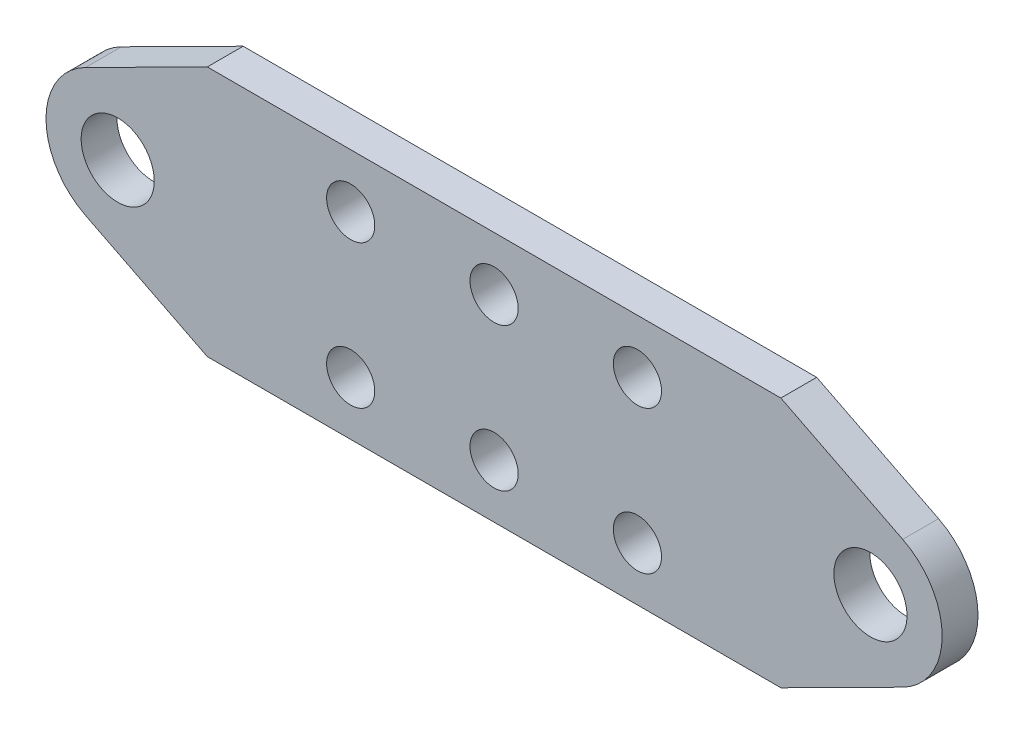
ISO-10303-21;
HEADER;
FILE_DESCRIPTION(('STEP AP214'),'2;1');
FILE_NAME('part.step','',(''),(''),'','','');
FILE_SCHEMA(('AUTOMOTIVE_DESIGN { 1 0 10303 214 1 1 1 1 }'));
ENDSEC;
DATA;
#1=APPLICATION_CONTEXT('core data for automotive mechanical design processes');
#2=APPLICATION_PROTOCOL_DEFINITION('international standard','automotive_design',2000,#1);
#3=PRODUCT_CONTEXT('',#1,'mechanical');
#4=PRODUCT('Part','Part','',(#3));
#5=PRODUCT_RELATED_PRODUCT_CATEGORY('part','',(#4));
#6=PRODUCT_DEFINITION_FORMATION('','',#4);
#7=PRODUCT_DEFINITION_CONTEXT('part definition',#1,'design');
#8=PRODUCT_DEFINITION('design','',#6,#7);
#9=PRODUCT_DEFINITION_SHAPE('','',#8);
#10=(LENGTH_UNIT() NAMED_UNIT(*) SI_UNIT(.MILLI.,.METRE.));
#11=(NAMED_UNIT(*) PLANE_ANGLE_UNIT() SI_UNIT($,.RADIAN.));
#12=(NAMED_UNIT(*) SI_UNIT($,.STERADIAN.) SOLID_ANGLE_UNIT());
#13=UNCERTAINTY_MEASURE_WITH_UNIT(LENGTH_MEASURE(1.E-05),#10,'distance_accuracy_value','');
#14=(GEOMETRIC_REPRESENTATION_CONTEXT(3) GLOBAL_UNCERTAINTY_ASSIGNED_CONTEXT((#13)) GLOBAL_UNIT_ASSIGNED_CONTEXT((#10,
#11,#12)) REPRESENTATION_CONTEXT('',''));
#15=CARTESIAN_POINT('',(0.,0.,0.));
#16=DIRECTION('',(0.,0.,1.));
#17=DIRECTION('',(1.,0.,0.));
#18=AXIS2_PLACEMENT_3D('',#15,#16,#17);
#19=CARTESIAN_POINT('',(0.,0.,0.));
#20=DIRECTION('',(0.,0.,1.));
#21=DIRECTION('',(1.,0.,0.));
#22=AXIS2_PLACEMENT_3D('',#19,#20,#21);
#23=PLANE('',#22);
#24=CARTESIAN_POINT('',(33.3375,0.,0.));
#25=DIRECTION('',(0.,0.,-1.));
#26=DIRECTION('',(-1.,0.,0.));
#27=AXIS2_PLACEMENT_3D('',#24,#25,#26);
#28=CIRCLE('',#27,3.2385);
#29=CARTESIAN_POINT('',(30.099,0.,0.));
#30=VERTEX_POINT('',#29);
#31=EDGE_CURVE('E165',#30,#30,#28,.F.);
#32=ORIENTED_EDGE('',*,*,#31,.T.);
#33=EDGE_LOOP('',(#32));
#34=FACE_BOUND('',#33,.T.);
#35=CARTESIAN_POINT('',(-33.3375,0.,0.));
#36=DIRECTION('',(0.,0.,-1.));
#37=DIRECTION('',(-1.,0.,0.));
#38=AXIS2_PLACEMENT_3D('',#35,#36,#37);
#39=CIRCLE('',#38,3.2385);
#40=CARTESIAN_POINT('',(-36.576,0.,0.));
#41=VERTEX_POINT('',#40);
#42=EDGE_CURVE('E168',#41,#41,#39,.F.);
#43=ORIENTED_EDGE('',*,*,#42,.T.);
#44=EDGE_LOOP('',(#43));
#45=FACE_BOUND('',#44,.T.);
#46=CARTESIAN_POINT('',(-12.7,-6.35,0.));
#47=DIRECTION('',(0.,0.,-1.));
#48=DIRECTION('',(-1.,0.,0.));
#49=AXIS2_PLACEMENT_3D('',#46,#47,#48);
#50=CIRCLE('',#49,2.1336);
#51=CARTESIAN_POINT('',(-14.8336,-6.35,0.));
#52=VERTEX_POINT('',#51);
#53=EDGE_CURVE('E171',#52,#52,#50,.F.);
#54=ORIENTED_EDGE('',*,*,#53,.T.);
#55=EDGE_LOOP('',(#54));
#56=FACE_BOUND('',#55,.T.);
#57=CARTESIAN_POINT('',(0.,-6.35,0.));
#58=DIRECTION('',(0.,0.,-1.));
#59=DIRECTION('',(-1.,0.,0.));
#60=AXIS2_PLACEMENT_3D('',#57,#58,#59);
#61=CIRCLE('',#60,2.1336);
#62=CARTESIAN_POINT('',(-2.13360000000001,-6.35,0.));
#63=VERTEX_POINT('',#62);
#64=EDGE_CURVE('E174',#63,#63,#61,.F.);
#65=ORIENTED_EDGE('',*,*,#64,.T.);
#66=EDGE_LOOP('',(#65));
#67=FACE_BOUND('',#66,.T.);
#68=CARTESIAN_POINT('',(12.7,-6.35,0.));
#69=DIRECTION('',(0.,0.,-1.));
#70=DIRECTION('',(-1.,0.,0.));
#71=AXIS2_PLACEMENT_3D('',#68,#69,#70);
#72=CIRCLE('',#71,2.1336);
#73=CARTESIAN_POINT('',(10.5664,-6.35,0.));
#74=VERTEX_POINT('',#73);
#75=EDGE_CURVE('E177',#74,#74,#72,.F.);
#76=ORIENTED_EDGE('',*,*,#75,.T.);
#77=EDGE_LOOP('',(#76));
#78=FACE_BOUND('',#77,.T.);
#79=CARTESIAN_POINT('',(12.7,6.35,0.));
#80=DIRECTION('',(0.,0.,-1.));
#81=DIRECTION('',(-1.,0.,0.));
#82=AXIS2_PLACEMENT_3D('',#79,#80,#81);
#83=CIRCLE('',#82,2.1336);
#84=CARTESIAN_POINT('',(10.5664,6.35,0.));
#85=VERTEX_POINT('',#84);
#86=EDGE_CURVE('E180',#85,#85,#83,.F.);
#87=ORIENTED_EDGE('',*,*,#86,.T.);
#88=EDGE_LOOP('',(#87));
#89=FACE_BOUND('',#88,.T.);
#90=CARTESIAN_POINT('',(0.,6.35,0.));
#91=DIRECTION('',(0.,0.,-1.));
#92=DIRECTION('',(-1.,0.,0.));
#93=AXIS2_PLACEMENT_3D('',#90,#91,#92);
#94=CIRCLE('',#93,2.1336);
#95=CARTESIAN_POINT('',(-2.13360000000001,6.35,0.));
#96=VERTEX_POINT('',#95);
#97=EDGE_CURVE('E183',#96,#96,#94,.F.);
#98=ORIENTED_EDGE('',*,*,#97,.T.);
#99=EDGE_LOOP('',(#98));
#100=FACE_BOUND('',#99,.T.);
#101=CARTESIAN_POINT('',(-12.7,6.35,0.));
#102=DIRECTION('',(0.,0.,-1.));
#103=DIRECTION('',(-1.,0.,0.));
#104=AXIS2_PLACEMENT_3D('',#101,#102,#103);
#105=CIRCLE('',#104,2.1336);
#106=CARTESIAN_POINT('',(-14.8336,6.35,0.));
#107=VERTEX_POINT('',#106);
#108=EDGE_CURVE('E118',#107,#107,#105,.F.);
#109=ORIENTED_EDGE('',*,*,#108,.T.);
#110=EDGE_LOOP('',(#109));
#111=FACE_BOUND('',#110,.T.);
#112=DIRECTION('',(1.,0.,0.));
#113=VECTOR('',#112,1.);
#114=CARTESIAN_POINT('',(0.,-11.1125,0.));
#115=LINE('',#114,#113);
#116=CARTESIAN_POINT('',(25.4,-11.1125,0.));
#117=VERTEX_POINT('',#116);
#118=CARTESIAN_POINT('',(-25.4,-11.1125,0.));
#119=VERTEX_POINT('',#118);
#120=EDGE_CURVE('E111',#117,#119,#115,.F.);
#121=ORIENTED_EDGE('',*,*,#120,.T.);
#122=DIRECTION('',(0.892957642288102,-0.450140699203343,0.));
#123=VECTOR('',#122,1.);
#124=CARTESIAN_POINT('',(-9.61345935362153,-19.0705084295533,0.));
#125=LINE('',#124,#123);
#126=CARTESIAN_POINT('',(-36.1958934399412,-5.67028102852945,0.));
#127=VERTEX_POINT('',#126);
#128=EDGE_CURVE('E121',#127,#119,#125,.T.);
#129=ORIENTED_EDGE('',*,*,#128,.F.);
#130=CARTESIAN_POINT('',(-33.3375,0.,0.));
#131=DIRECTION('',(0.,0.,-1.));
#132=DIRECTION('',(-1.,0.,0.));
#133=AXIS2_PLACEMENT_3D('',#130,#131,#132);
#134=CIRCLE('',#133,6.35);
#135=CARTESIAN_POINT('',(-36.1958934399412,5.67028102852945,0.));
#136=VERTEX_POINT('',#135);
#137=EDGE_CURVE('E124',#136,#127,#134,.F.);
#138=ORIENTED_EDGE('',*,*,#137,.F.);
#139=DIRECTION('',(0.892957642288102,0.450140699203343,0.));
#140=VECTOR('',#139,1.);
#141=CARTESIAN_POINT('',(-9.61345935362155,19.0705084295533,0.));
#142=LINE('',#141,#140);
#143=CARTESIAN_POINT('',(-25.4,11.1125,0.));
#144=VERTEX_POINT('',#143);
#145=EDGE_CURVE('E127',#136,#144,#142,.T.);
#146=ORIENTED_EDGE('',*,*,#145,.T.);
#147=DIRECTION('',(1.,0.,0.));
#148=VECTOR('',#147,1.);
#149=CARTESIAN_POINT('',(0.,11.1125,0.));
#150=LINE('',#149,#148);
#151=CARTESIAN_POINT('',(25.4,11.1125,0.));
#152=VERTEX_POINT('',#151);
#153=EDGE_CURVE('E83',#152,#144,#150,.F.);
#154=ORIENTED_EDGE('',*,*,#153,.F.);
#155=DIRECTION('',(-0.892957642288102,0.450140699203342,0.));
#156=VECTOR('',#155,1.);
#157=CARTESIAN_POINT('',(9.6134593536215,19.0705084295533,0.));
#158=LINE('',#157,#156);
#159=CARTESIAN_POINT('',(36.1958934399412,5.67028102852946,0.));
#160=VERTEX_POINT('',#159);
#161=EDGE_CURVE('E80',#160,#152,#158,.T.);
#162=ORIENTED_EDGE('',*,*,#161,.F.);
#163=CARTESIAN_POINT('',(33.3375,0.,0.));
#164=DIRECTION('',(0.,0.,-1.));
#165=DIRECTION('',(-1.,0.,0.));
#166=AXIS2_PLACEMENT_3D('',#163,#164,#165);
#167=CIRCLE('',#166,6.35);
#168=CARTESIAN_POINT('',(36.1958934399412,-5.67028102852943,0.));
#169=VERTEX_POINT('',#168);
#170=EDGE_CURVE('E20',#169,#160,#167,.F.);
#171=ORIENTED_EDGE('',*,*,#170,.F.);
#172=DIRECTION('',(-0.892957642288102,-0.450140699203343,0.));
#173=VECTOR('',#172,1.);
#174=CARTESIAN_POINT('',(9.61345935362154,-19.0705084295533,0.));
#175=LINE('',#174,#173);
#176=EDGE_CURVE('E95',#169,#117,#175,.T.);
#177=ORIENTED_EDGE('',*,*,#176,.T.);
#178=EDGE_LOOP('',(#121,#129,#138,#146,#154,#162,#171,#177));
#179=FACE_BOUND('',#178,.T.);
#180=ADVANCED_FACE('F17',(#34,#45,#56,#67,#78,#89,#100,#111,#179),#23,.F.);
#181=CARTESIAN_POINT('',(9.61345935362154,-19.0705084295533,3.175));
#182=DIRECTION('',(-0.450140699203343,0.892957642288102,0.));
#183=DIRECTION('',(-0.892957642288102,-0.450140699203343,0.));
#184=AXIS2_PLACEMENT_3D('',#181,#182,#183);
#185=PLANE('',#184);
#186=DIRECTION('',(0.,0.,-1.));
#187=VECTOR('',#186,1.);
#188=CARTESIAN_POINT('',(36.1958934399412,-5.67028102852943,3.175));
#189=LINE('',#188,#187);
#190=CARTESIAN_POINT('',(36.1958934399412,-5.67028102852943,3.175));
#191=VERTEX_POINT('',#190);
#192=EDGE_CURVE('E88',#191,#169,#189,.T.);
#193=ORIENTED_EDGE('',*,*,#192,.F.);
#194=DIRECTION('',(0.892957642288102,0.450140699203343,0.));
#195=VECTOR('',#194,1.);
#196=CARTESIAN_POINT('',(25.4,-11.1125,3.175));
#197=LINE('',#196,#195);
#198=CARTESIAN_POINT('',(25.4,-11.1125,3.175));
#199=VERTEX_POINT('',#198);
#200=EDGE_CURVE('E164',#199,#191,#197,.T.);
#201=ORIENTED_EDGE('',*,*,#200,.F.);
#202=DIRECTION('',(0.,0.,1.));
#203=VECTOR('',#202,1.);
#204=CARTESIAN_POINT('',(25.4,-11.1125,3.175));
#205=LINE('',#204,#203);
#206=EDGE_CURVE('E108',#199,#117,#205,.F.);
#207=ORIENTED_EDGE('',*,*,#206,.T.);
#208=ORIENTED_EDGE('',*,*,#176,.F.);
#209=EDGE_LOOP('',(#193,#201,#207,#208));
#210=FACE_BOUND('',#209,.T.);
#211=ADVANCED_FACE('F293',(#210),#185,.F.);
#212=CARTESIAN_POINT('',(33.3375,0.,3.175));
#213=DIRECTION('',(0.,0.,-1.));
#214=DIRECTION('',(-1.,0.,0.));
#215=AXIS2_PLACEMENT_3D('',#212,#213,#214);
#216=CYLINDRICAL_SURFACE('',#215,6.35);
#217=CARTESIAN_POINT('',(33.3375,0.,3.175));
#218=DIRECTION('',(0.,0.,-1.));
#219=DIRECTION('',(-1.,0.,0.));
#220=AXIS2_PLACEMENT_3D('',#217,#218,#219);
#221=CIRCLE('',#220,6.35);
#222=CARTESIAN_POINT('',(36.1958934399412,5.67028102852946,3.175));
#223=VERTEX_POINT('',#222);
#224=EDGE_CURVE('E162',#191,#223,#221,.F.);
#225=ORIENTED_EDGE('',*,*,#224,.F.);
#226=ORIENTED_EDGE('',*,*,#192,.T.);
#227=ORIENTED_EDGE('',*,*,#170,.T.);
#228=DIRECTION('',(0.,0.,1.));
#229=VECTOR('',#228,1.);
#230=CARTESIAN_POINT('',(36.1958934399412,5.67028102852946,3.175));
#231=LINE('',#230,#229);
#232=EDGE_CURVE('E87',#223,#160,#231,.F.);
#233=ORIENTED_EDGE('',*,*,#232,.F.);
#234=EDGE_LOOP('',(#225,#226,#227,#233));
#235=FACE_BOUND('',#234,.T.);
#236=ADVANCED_FACE('F93',(#235),#216,.T.);
#237=CARTESIAN_POINT('',(9.6134593536215,19.0705084295533,3.175));
#238=DIRECTION('',(0.450140699203342,0.892957642288102,0.));
#239=DIRECTION('',(-0.892957642288102,0.450140699203342,0.));
#240=AXIS2_PLACEMENT_3D('',#237,#238,#239);
#241=PLANE('',#240);
#242=DIRECTION('',(-0.892957642288102,0.450140699203342,0.));
#243=VECTOR('',#242,1.);
#244=CARTESIAN_POINT('',(36.1958934399412,5.67028102852946,3.175));
#245=LINE('',#244,#243);
#246=CARTESIAN_POINT('',(25.4,11.1125,3.175));
#247=VERTEX_POINT('',#246);
#248=EDGE_CURVE('E98',#223,#247,#245,.T.);
#249=ORIENTED_EDGE('',*,*,#248,.F.);
#250=ORIENTED_EDGE('',*,*,#232,.T.);
#251=ORIENTED_EDGE('',*,*,#161,.T.);
#252=DIRECTION('',(0.,0.,1.));
#253=VECTOR('',#252,1.);
#254=CARTESIAN_POINT('',(25.4,11.1125,3.175));
#255=LINE('',#254,#253);
#256=EDGE_CURVE('E101',#247,#152,#255,.F.);
#257=ORIENTED_EDGE('',*,*,#256,.F.);
#258=EDGE_LOOP('',(#249,#250,#251,#257));
#259=FACE_BOUND('',#258,.T.);
#260=ADVANCED_FACE('F96',(#259),#241,.T.);
#261=CARTESIAN_POINT('',(0.,11.1125,3.175));
#262=DIRECTION('',(0.,1.,0.));
#263=DIRECTION('',(0.,0.,1.));
#264=AXIS2_PLACEMENT_3D('',#261,#262,#263);
#265=PLANE('',#264);
#266=DIRECTION('',(1.,0.,0.));
#267=VECTOR('',#266,1.);
#268=CARTESIAN_POINT('',(0.,11.1125,3.175));
#269=LINE('',#268,#267);
#270=CARTESIAN_POINT('',(-25.4,11.1125,3.175));
#271=VERTEX_POINT('',#270);
#272=EDGE_CURVE('E201',#247,#271,#269,.F.);
#273=ORIENTED_EDGE('',*,*,#272,.F.);
#274=ORIENTED_EDGE('',*,*,#256,.T.);
#275=ORIENTED_EDGE('',*,*,#153,.T.);
#276=DIRECTION('',(0.,0.,1.));
#277=VECTOR('',#276,1.);
#278=CARTESIAN_POINT('',(-25.4,11.1125,3.175));
#279=LINE('',#278,#277);
#280=EDGE_CURVE('E130',#144,#271,#279,.T.);
#281=ORIENTED_EDGE('',*,*,#280,.T.);
#282=EDGE_LOOP('',(#273,#274,#275,#281));
#283=FACE_BOUND('',#282,.T.);
#284=ADVANCED_FACE('F207',(#283),#265,.T.);
#285=CARTESIAN_POINT('',(-9.61345935362155,19.0705084295533,3.175));
#286=DIRECTION('',(0.450140699203343,-0.892957642288102,0.));
#287=DIRECTION('',(0.892957642288102,0.450140699203343,0.));
#288=AXIS2_PLACEMENT_3D('',#285,#286,#287);
#289=PLANE('',#288);
#290=DIRECTION('',(0.,0.,-1.));
#291=VECTOR('',#290,1.);
#292=CARTESIAN_POINT('',(-36.1958934399412,5.67028102852945,3.175));
#293=LINE('',#292,#291);
#294=CARTESIAN_POINT('',(-36.1958934399412,5.67028102852945,3.175));
#295=VERTEX_POINT('',#294);
#296=EDGE_CURVE('E129',#295,#136,#293,.T.);
#297=ORIENTED_EDGE('',*,*,#296,.F.);
#298=DIRECTION('',(-0.892957642288102,-0.450140699203343,0.));
#299=VECTOR('',#298,1.);
#300=CARTESIAN_POINT('',(-25.4,11.1125,3.175));
#301=LINE('',#300,#299);
#302=EDGE_CURVE('E161',#271,#295,#301,.T.);
#303=ORIENTED_EDGE('',*,*,#302,.F.);
#304=ORIENTED_EDGE('',*,*,#280,.F.);
#305=ORIENTED_EDGE('',*,*,#145,.F.);
#306=EDGE_LOOP('',(#297,#303,#304,#305));
#307=FACE_BOUND('',#306,.T.);
#308=ADVANCED_FACE('F233',(#307),#289,.F.);
#309=CARTESIAN_POINT('',(-33.3375,0.,3.175));
#310=DIRECTION('',(0.,0.,-1.));
#311=DIRECTION('',(-1.,0.,0.));
#312=AXIS2_PLACEMENT_3D('',#309,#310,#311);
#313=CYLINDRICAL_SURFACE('',#312,6.35);
#314=ORIENTED_EDGE('',*,*,#137,.T.);
#315=DIRECTION('',(0.,0.,1.));
#316=VECTOR('',#315,1.);
#317=CARTESIAN_POINT('',(-36.1958934399412,-5.67028102852945,3.175));
#318=LINE('',#317,#316);
#319=CARTESIAN_POINT('',(-36.1958934399412,-5.67028102852945,3.175));
#320=VERTEX_POINT('',#319);
#321=EDGE_CURVE('E123',#320,#127,#318,.F.);
#322=ORIENTED_EDGE('',*,*,#321,.F.);
#323=CARTESIAN_POINT('',(-33.3375,0.,3.175));
#324=DIRECTION('',(0.,0.,-1.));
#325=DIRECTION('',(-1.,0.,0.));
#326=AXIS2_PLACEMENT_3D('',#323,#324,#325);
#327=CIRCLE('',#326,6.35);
#328=EDGE_CURVE('E158',#295,#320,#327,.F.);
#329=ORIENTED_EDGE('',*,*,#328,.F.);
#330=ORIENTED_EDGE('',*,*,#296,.T.);
#331=EDGE_LOOP('',(#314,#322,#329,#330));
#332=FACE_BOUND('',#331,.T.);
#333=ADVANCED_FACE('F235',(#332),#313,.T.);
#334=CARTESIAN_POINT('',(-9.61345935362153,-19.0705084295533,3.175));
#335=DIRECTION('',(-0.450140699203343,-0.892957642288102,0.));
#336=DIRECTION('',(0.892957642288102,-0.450140699203343,0.));
#337=AXIS2_PLACEMENT_3D('',#334,#335,#336);
#338=PLANE('',#337);
#339=DIRECTION('',(0.892957642288102,-0.450140699203343,0.));
#340=VECTOR('',#339,1.);
#341=CARTESIAN_POINT('',(-36.1958934399412,-5.67028102852945,3.175));
#342=LINE('',#341,#340);
#343=CARTESIAN_POINT('',(-25.4,-11.1125,3.175));
#344=VERTEX_POINT('',#343);
#345=EDGE_CURVE('E160',#320,#344,#342,.T.);
#346=ORIENTED_EDGE('',*,*,#345,.F.);
#347=ORIENTED_EDGE('',*,*,#321,.T.);
#348=ORIENTED_EDGE('',*,*,#128,.T.);
#349=DIRECTION('',(0.,0.,1.));
#350=VECTOR('',#349,1.);
#351=CARTESIAN_POINT('',(-25.4,-11.1125,3.175));
#352=LINE('',#351,#350);
#353=EDGE_CURVE('E35',#119,#344,#352,.T.);
#354=ORIENTED_EDGE('',*,*,#353,.T.);
#355=EDGE_LOOP('',(#346,#347,#348,#354));
#356=FACE_BOUND('',#355,.T.);
#357=ADVANCED_FACE('F236',(#356),#338,.T.);
#358=CARTESIAN_POINT('',(0.,-11.1125,3.175));
#359=DIRECTION('',(0.,1.,0.));
#360=DIRECTION('',(0.,0.,1.));
#361=AXIS2_PLACEMENT_3D('',#358,#359,#360);
#362=PLANE('',#361);
#363=ORIENTED_EDGE('',*,*,#206,.F.);
#364=DIRECTION('',(1.,0.,0.));
#365=VECTOR('',#364,1.);
#366=CARTESIAN_POINT('',(0.,-11.1125,3.175));
#367=LINE('',#366,#365);
#368=EDGE_CURVE('E157',#344,#199,#367,.T.);
#369=ORIENTED_EDGE('',*,*,#368,.F.);
#370=ORIENTED_EDGE('',*,*,#353,.F.);
#371=ORIENTED_EDGE('',*,*,#120,.F.);
#372=EDGE_LOOP('',(#363,#369,#370,#371));
#373=FACE_BOUND('',#372,.T.);
#374=ADVANCED_FACE('F238',(#373),#362,.F.);
#375=CARTESIAN_POINT('',(-12.7,6.35,3.175));
#376=DIRECTION('',(0.,0.,-1.));
#377=DIRECTION('',(-1.,0.,0.));
#378=AXIS2_PLACEMENT_3D('',#375,#376,#377);
#379=CYLINDRICAL_SURFACE('',#378,2.1336);
#380=CARTESIAN_POINT('',(-12.7,6.35,3.175));
#381=DIRECTION('',(0.,0.,-1.));
#382=DIRECTION('',(-1.,0.,0.));
#383=AXIS2_PLACEMENT_3D('',#380,#381,#382);
#384=CIRCLE('',#383,2.1336);
#385=CARTESIAN_POINT('',(-14.8336,6.35,3.175));
#386=VERTEX_POINT('',#385);
#387=EDGE_CURVE('E154',#386,#386,#384,.T.);
#388=ORIENTED_EDGE('',*,*,#387,.F.);
#389=EDGE_LOOP('',(#388));
#390=FACE_BOUND('',#389,.T.);
#391=ORIENTED_EDGE('',*,*,#108,.F.);
#392=EDGE_LOOP('',(#391));
#393=FACE_BOUND('',#392,.T.);
#394=ADVANCED_FACE('F245',(#390,#393),#379,.F.);
#395=CARTESIAN_POINT('',(0.,6.35,3.175));
#396=DIRECTION('',(0.,0.,-1.));
#397=DIRECTION('',(-1.,0.,0.));
#398=AXIS2_PLACEMENT_3D('',#395,#396,#397);
#399=CYLINDRICAL_SURFACE('',#398,2.1336);
#400=CARTESIAN_POINT('',(0.,6.35,3.175));
#401=DIRECTION('',(0.,0.,-1.));
#402=DIRECTION('',(-1.,0.,0.));
#403=AXIS2_PLACEMENT_3D('',#400,#401,#402);
#404=CIRCLE('',#403,2.1336);
#405=CARTESIAN_POINT('',(-2.13360000000001,6.35,3.175));
#406=VERTEX_POINT('',#405);
#407=EDGE_CURVE('E151',#406,#406,#404,.T.);
#408=ORIENTED_EDGE('',*,*,#407,.F.);
#409=EDGE_LOOP('',(#408));
#410=FACE_BOUND('',#409,.T.);
#411=ORIENTED_EDGE('',*,*,#97,.F.);
#412=EDGE_LOOP('',(#411));
#413=FACE_BOUND('',#412,.T.);
#414=ADVANCED_FACE('F279',(#410,#413),#399,.F.);
#415=CARTESIAN_POINT('',(12.7,6.35,3.175));
#416=DIRECTION('',(0.,0.,-1.));
#417=DIRECTION('',(-1.,0.,0.));
#418=AXIS2_PLACEMENT_3D('',#415,#416,#417);
#419=CYLINDRICAL_SURFACE('',#418,2.1336);
#420=CARTESIAN_POINT('',(12.7,6.35,3.175));
#421=DIRECTION('',(0.,0.,-1.));
#422=DIRECTION('',(-1.,0.,0.));
#423=AXIS2_PLACEMENT_3D('',#420,#421,#422);
#424=CIRCLE('',#423,2.1336);
#425=CARTESIAN_POINT('',(10.5664,6.35,3.175));
#426=VERTEX_POINT('',#425);
#427=EDGE_CURVE('E148',#426,#426,#424,.T.);
#428=ORIENTED_EDGE('',*,*,#427,.F.);
#429=EDGE_LOOP('',(#428));
#430=FACE_BOUND('',#429,.T.);
#431=ORIENTED_EDGE('',*,*,#86,.F.);
#432=EDGE_LOOP('',(#431));
#433=FACE_BOUND('',#432,.T.);
#434=ADVANCED_FACE('F275',(#430,#433),#419,.F.);
#435=CARTESIAN_POINT('',(12.7,-6.35,3.175));
#436=DIRECTION('',(0.,0.,-1.));
#437=DIRECTION('',(-1.,0.,0.));
#438=AXIS2_PLACEMENT_3D('',#435,#436,#437);
#439=CYLINDRICAL_SURFACE('',#438,2.1336);
#440=CARTESIAN_POINT('',(12.7,-6.35,3.175));
#441=DIRECTION('',(0.,0.,-1.));
#442=DIRECTION('',(-1.,0.,0.));
#443=AXIS2_PLACEMENT_3D('',#440,#441,#442);
#444=CIRCLE('',#443,2.1336);
#445=CARTESIAN_POINT('',(10.5664,-6.35,3.175));
#446=VERTEX_POINT('',#445);
#447=EDGE_CURVE('E145',#446,#446,#444,.T.);
#448=ORIENTED_EDGE('',*,*,#447,.F.);
#449=EDGE_LOOP('',(#448));
#450=FACE_BOUND('',#449,.T.);
#451=ORIENTED_EDGE('',*,*,#75,.F.);
#452=EDGE_LOOP('',(#451));
#453=FACE_BOUND('',#452,.T.);
#454=ADVANCED_FACE('F271',(#450,#453),#439,.F.);
#455=CARTESIAN_POINT('',(0.,-6.35,3.175));
#456=DIRECTION('',(0.,0.,-1.));
#457=DIRECTION('',(-1.,0.,0.));
#458=AXIS2_PLACEMENT_3D('',#455,#456,#457);
#459=CYLINDRICAL_SURFACE('',#458,2.1336);
#460=CARTESIAN_POINT('',(0.,-6.35,3.175));
#461=DIRECTION('',(0.,0.,-1.));
#462=DIRECTION('',(-1.,0.,0.));
#463=AXIS2_PLACEMENT_3D('',#460,#461,#462);
#464=CIRCLE('',#463,2.1336);
#465=CARTESIAN_POINT('',(-2.13360000000001,-6.35,3.175));
#466=VERTEX_POINT('',#465);
#467=EDGE_CURVE('E142',#466,#466,#464,.T.);
#468=ORIENTED_EDGE('',*,*,#467,.F.);
#469=EDGE_LOOP('',(#468));
#470=FACE_BOUND('',#469,.T.);
#471=ORIENTED_EDGE('',*,*,#64,.F.);
#472=EDGE_LOOP('',(#471));
#473=FACE_BOUND('',#472,.T.);
#474=ADVANCED_FACE('F267',(#470,#473),#459,.F.);
#475=CARTESIAN_POINT('',(-12.7,-6.35,3.175));
#476=DIRECTION('',(0.,0.,-1.));
#477=DIRECTION('',(-1.,0.,0.));
#478=AXIS2_PLACEMENT_3D('',#475,#476,#477);
#479=CYLINDRICAL_SURFACE('',#478,2.1336);
#480=CARTESIAN_POINT('',(-12.7,-6.35,3.175));
#481=DIRECTION('',(0.,0.,-1.));
#482=DIRECTION('',(-1.,0.,0.));
#483=AXIS2_PLACEMENT_3D('',#480,#481,#482);
#484=CIRCLE('',#483,2.1336);
#485=CARTESIAN_POINT('',(-14.8336,-6.35,3.175));
#486=VERTEX_POINT('',#485);
#487=EDGE_CURVE('E139',#486,#486,#484,.T.);
#488=ORIENTED_EDGE('',*,*,#487,.F.);
#489=EDGE_LOOP('',(#488));
#490=FACE_BOUND('',#489,.T.);
#491=ORIENTED_EDGE('',*,*,#53,.F.);
#492=EDGE_LOOP('',(#491));
#493=FACE_BOUND('',#492,.T.);
#494=ADVANCED_FACE('F263',(#490,#493),#479,.F.);
#495=CARTESIAN_POINT('',(-33.3375,0.,3.175));
#496=DIRECTION('',(0.,0.,-1.));
#497=DIRECTION('',(-1.,0.,0.));
#498=AXIS2_PLACEMENT_3D('',#495,#496,#497);
#499=CYLINDRICAL_SURFACE('',#498,3.2385);
#500=CARTESIAN_POINT('',(-33.3375,0.,3.175));
#501=DIRECTION('',(0.,0.,-1.));
#502=DIRECTION('',(-1.,0.,0.));
#503=AXIS2_PLACEMENT_3D('',#500,#501,#502);
#504=CIRCLE('',#503,3.2385);
#505=CARTESIAN_POINT('',(-36.576,0.,3.175));
#506=VERTEX_POINT('',#505);
#507=EDGE_CURVE('E26',#506,#506,#504,.T.);
#508=ORIENTED_EDGE('',*,*,#507,.F.);
#509=EDGE_LOOP('',(#508));
#510=FACE_BOUND('',#509,.T.);
#511=ORIENTED_EDGE('',*,*,#42,.F.);
#512=EDGE_LOOP('',(#511));
#513=FACE_BOUND('',#512,.T.);
#514=ADVANCED_FACE('F256',(#510,#513),#499,.F.);
#515=CARTESIAN_POINT('',(33.3375,0.,3.175));
#516=DIRECTION('',(0.,0.,-1.));
#517=DIRECTION('',(-1.,0.,0.));
#518=AXIS2_PLACEMENT_3D('',#515,#516,#517);
#519=CYLINDRICAL_SURFACE('',#518,3.2385);
#520=CARTESIAN_POINT('',(33.3375,0.,3.175));
#521=DIRECTION('',(0.,0.,-1.));
#522=DIRECTION('',(-1.,0.,0.));
#523=AXIS2_PLACEMENT_3D('',#520,#521,#522);
#524=CIRCLE('',#523,3.2385);
#525=CARTESIAN_POINT('',(30.099,0.,3.175));
#526=VERTEX_POINT('',#525);
#527=EDGE_CURVE('E11',#526,#526,#524,.T.);
#528=ORIENTED_EDGE('',*,*,#527,.F.);
#529=EDGE_LOOP('',(#528));
#530=FACE_BOUND('',#529,.T.);
#531=ORIENTED_EDGE('',*,*,#31,.F.);
#532=EDGE_LOOP('',(#531));
#533=FACE_BOUND('',#532,.T.);
#534=ADVANCED_FACE('F250',(#530,#533),#519,.F.);
#535=CARTESIAN_POINT('',(0.,0.,3.175));
#536=DIRECTION('',(0.,0.,1.));
#537=DIRECTION('',(1.,0.,0.));
#538=AXIS2_PLACEMENT_3D('',#535,#536,#537);
#539=PLANE('',#538);
#540=ORIENTED_EDGE('',*,*,#527,.T.);
#541=EDGE_LOOP('',(#540));
#542=FACE_BOUND('',#541,.T.);
#543=ORIENTED_EDGE('',*,*,#507,.T.);
#544=EDGE_LOOP('',(#543));
#545=FACE_BOUND('',#544,.T.);
#546=ORIENTED_EDGE('',*,*,#487,.T.);
#547=EDGE_LOOP('',(#546));
#548=FACE_BOUND('',#547,.T.);
#549=ORIENTED_EDGE('',*,*,#467,.T.);
#550=EDGE_LOOP('',(#549));
#551=FACE_BOUND('',#550,.T.);
#552=ORIENTED_EDGE('',*,*,#447,.T.);
#553=EDGE_LOOP('',(#552));
#554=FACE_BOUND('',#553,.T.);
#555=ORIENTED_EDGE('',*,*,#427,.T.);
#556=EDGE_LOOP('',(#555));
#557=FACE_BOUND('',#556,.T.);
#558=ORIENTED_EDGE('',*,*,#407,.T.);
#559=EDGE_LOOP('',(#558));
#560=FACE_BOUND('',#559,.T.);
#561=ORIENTED_EDGE('',*,*,#387,.T.);
#562=EDGE_LOOP('',(#561));
#563=FACE_BOUND('',#562,.T.);
#564=ORIENTED_EDGE('',*,*,#345,.T.);
#565=ORIENTED_EDGE('',*,*,#368,.T.);
#566=ORIENTED_EDGE('',*,*,#200,.T.);
#567=ORIENTED_EDGE('',*,*,#224,.T.);
#568=ORIENTED_EDGE('',*,*,#248,.T.);
#569=ORIENTED_EDGE('',*,*,#272,.T.);
#570=ORIENTED_EDGE('',*,*,#302,.T.);
#571=ORIENTED_EDGE('',*,*,#328,.T.);
#572=EDGE_LOOP('',(#564,#565,#566,#567,#568,#569,#570,#571));
#573=FACE_BOUND('',#572,.T.);
#574=ADVANCED_FACE('F213',(#542,#545,#548,#551,#554,#557,#560,#563,#573),#539,.T.);
#575=CLOSED_SHELL('',(#180,#211,#236,#260,#284,#308,#333,#357,#374,#394,#414,#434,#454,#474,
#494,#514,#534,#574));
#576=MANIFOLD_SOLID_BREP('B1',#575);
#577=ADVANCED_BREP_SHAPE_REPRESENTATION('',(#18,#576),#14);
#578=SHAPE_DEFINITION_REPRESENTATION(#9,#577);
ENDSEC;
END-ISO-10303-21;
